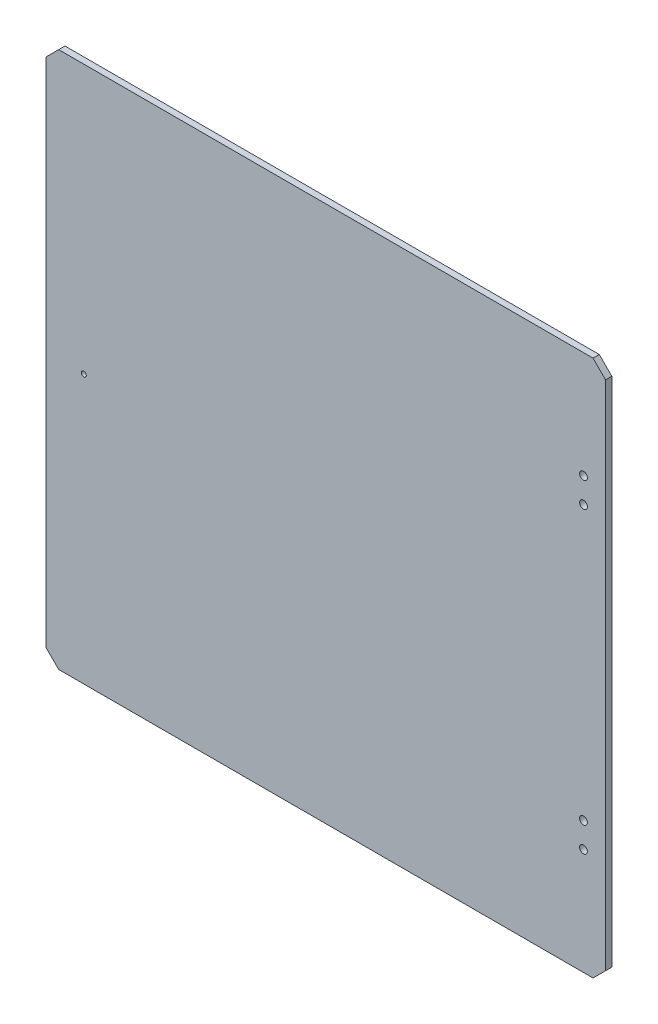
ISO-10303-21;
HEADER;
FILE_DESCRIPTION(('STEP AP214'),'2;1');
FILE_NAME('part.step','',(''),(''),'','','');
FILE_SCHEMA(('AUTOMOTIVE_DESIGN { 1 0 10303 214 1 1 1 1 }'));
ENDSEC;
DATA;
#1=APPLICATION_CONTEXT('core data for automotive mechanical design processes');
#2=APPLICATION_PROTOCOL_DEFINITION('international standard','automotive_design',2000,#1);
#3=PRODUCT_CONTEXT('',#1,'mechanical');
#4=PRODUCT('Part','Part','',(#3));
#5=PRODUCT_RELATED_PRODUCT_CATEGORY('part','',(#4));
#6=PRODUCT_DEFINITION_FORMATION('','',#4);
#7=PRODUCT_DEFINITION_CONTEXT('part definition',#1,'design');
#8=PRODUCT_DEFINITION('design','',#6,#7);
#9=PRODUCT_DEFINITION_SHAPE('','',#8);
#10=(LENGTH_UNIT() NAMED_UNIT(*) SI_UNIT(.MILLI.,.METRE.));
#11=(NAMED_UNIT(*) PLANE_ANGLE_UNIT() SI_UNIT($,.RADIAN.));
#12=(NAMED_UNIT(*) SI_UNIT($,.STERADIAN.) SOLID_ANGLE_UNIT());
#13=UNCERTAINTY_MEASURE_WITH_UNIT(LENGTH_MEASURE(1.E-05),#10,'distance_accuracy_value','');
#14=(GEOMETRIC_REPRESENTATION_CONTEXT(3) GLOBAL_UNCERTAINTY_ASSIGNED_CONTEXT((#13)) GLOBAL_UNIT_ASSIGNED_CONTEXT((#10,
#11,#12)) REPRESENTATION_CONTEXT('',''));
#15=CARTESIAN_POINT('',(0.,0.,0.));
#16=DIRECTION('',(0.,0.,1.));
#17=DIRECTION('',(1.,0.,0.));
#18=AXIS2_PLACEMENT_3D('',#15,#16,#17);
#19=CARTESIAN_POINT('',(0.,0.,5.));
#20=DIRECTION('',(0.,0.,1.));
#21=DIRECTION('',(1.,0.,0.));
#22=AXIS2_PLACEMENT_3D('',#19,#20,#21);
#23=PLANE('',#22);
#24=CARTESIAN_POINT('',(205.4,-129.,5.));
#25=DIRECTION('',(0.,0.,1.));
#26=DIRECTION('',(-1.,0.,0.));
#27=AXIS2_PLACEMENT_3D('',#24,#25,#26);
#28=CIRCLE('',#27,3.09999999999999);
#29=CARTESIAN_POINT('',(202.3,-129.,5.));
#30=VERTEX_POINT('',#29);
#31=EDGE_CURVE('E209',#30,#30,#28,.T.);
#32=ORIENTED_EDGE('',*,*,#31,.F.);
#33=EDGE_LOOP('',(#32));
#34=FACE_BOUND('',#33,.T.);
#35=CARTESIAN_POINT('',(205.4,109.,5.));
#36=DIRECTION('',(0.,0.,1.));
#37=DIRECTION('',(1.,0.,0.));
#38=AXIS2_PLACEMENT_3D('',#35,#36,#37);
#39=CIRCLE('',#38,3.09999999999999);
#40=CARTESIAN_POINT('',(208.5,109.,5.));
#41=VERTEX_POINT('',#40);
#42=EDGE_CURVE('E195',#41,#41,#39,.T.);
#43=ORIENTED_EDGE('',*,*,#42,.F.);
#44=EDGE_LOOP('',(#43));
#45=FACE_BOUND('',#44,.T.);
#46=DIRECTION('',(0.,-1.,0.));
#47=VECTOR('',#46,1.);
#48=CARTESIAN_POINT('',(-223.,-204.,5.));
#49=LINE('',#48,#47);
#50=CARTESIAN_POINT('',(-223.,204.,5.));
#51=VERTEX_POINT('',#50);
#52=CARTESIAN_POINT('',(-223.,-204.,5.));
#53=VERTEX_POINT('',#52);
#54=EDGE_CURVE('E158',#51,#53,#49,.T.);
#55=ORIENTED_EDGE('',*,*,#54,.T.);
#56=DIRECTION('',(0.707106781186548,-0.707106781186546,0.));
#57=VECTOR('',#56,1.);
#58=CARTESIAN_POINT('',(-213.,-214.,5.));
#59=LINE('',#58,#57);
#60=CARTESIAN_POINT('',(-213.,-214.,5.));
#61=VERTEX_POINT('',#60);
#62=EDGE_CURVE('E105',#53,#61,#59,.T.);
#63=ORIENTED_EDGE('',*,*,#62,.T.);
#64=DIRECTION('',(1.,0.,0.));
#65=VECTOR('',#64,1.);
#66=CARTESIAN_POINT('',(213.,-214.,5.));
#67=LINE('',#66,#65);
#68=CARTESIAN_POINT('',(213.,-214.,5.));
#69=VERTEX_POINT('',#68);
#70=EDGE_CURVE('E173',#61,#69,#67,.T.);
#71=ORIENTED_EDGE('',*,*,#70,.T.);
#72=DIRECTION('',(0.707106781186547,0.707106781186547,0.));
#73=VECTOR('',#72,1.);
#74=CARTESIAN_POINT('',(213.,-214.,5.));
#75=LINE('',#74,#73);
#76=CARTESIAN_POINT('',(223.,-204.,5.));
#77=VERTEX_POINT('',#76);
#78=EDGE_CURVE('E186',#69,#77,#75,.T.);
#79=ORIENTED_EDGE('',*,*,#78,.T.);
#80=DIRECTION('',(0.,1.,0.));
#81=VECTOR('',#80,1.);
#82=CARTESIAN_POINT('',(223.,204.,5.));
#83=LINE('',#82,#81);
#84=CARTESIAN_POINT('',(223.,204.,5.));
#85=VERTEX_POINT('',#84);
#86=EDGE_CURVE('E125',#77,#85,#83,.T.);
#87=ORIENTED_EDGE('',*,*,#86,.T.);
#88=DIRECTION('',(-0.707106781186547,0.707106781186547,0.));
#89=VECTOR('',#88,1.);
#90=CARTESIAN_POINT('',(223.,204.,5.));
#91=LINE('',#90,#89);
#92=CARTESIAN_POINT('',(213.,214.,5.));
#93=VERTEX_POINT('',#92);
#94=EDGE_CURVE('E119',#85,#93,#91,.T.);
#95=ORIENTED_EDGE('',*,*,#94,.T.);
#96=DIRECTION('',(-1.,0.,0.));
#97=VECTOR('',#96,1.);
#98=CARTESIAN_POINT('',(213.,214.,5.));
#99=LINE('',#98,#97);
#100=CARTESIAN_POINT('',(-213.,214.,5.));
#101=VERTEX_POINT('',#100);
#102=EDGE_CURVE('E123',#93,#101,#99,.T.);
#103=ORIENTED_EDGE('',*,*,#102,.T.);
#104=DIRECTION('',(-0.70710678118655,-0.707106781186544,0.));
#105=VECTOR('',#104,1.);
#106=CARTESIAN_POINT('',(-223.,204.,5.));
#107=LINE('',#106,#105);
#108=EDGE_CURVE('E62',#101,#51,#107,.T.);
#109=ORIENTED_EDGE('',*,*,#108,.T.);
#110=EDGE_LOOP('',(#55,#63,#71,#79,#87,#95,#103,#109));
#111=FACE_BOUND('',#110,.T.);
#112=CARTESIAN_POINT('',(205.4,129.,5.));
#113=DIRECTION('',(0.,0.,1.));
#114=DIRECTION('',(1.,0.,0.));
#115=AXIS2_PLACEMENT_3D('',#112,#113,#114);
#116=CIRCLE('',#115,3.09999999999999);
#117=CARTESIAN_POINT('',(208.5,129.,5.));
#118=VERTEX_POINT('',#117);
#119=EDGE_CURVE('E147',#118,#118,#116,.T.);
#120=ORIENTED_EDGE('',*,*,#119,.F.);
#121=EDGE_LOOP('',(#120));
#122=FACE_BOUND('',#121,.T.);
#123=CARTESIAN_POINT('',(205.4,-109.,5.));
#124=DIRECTION('',(0.,0.,1.));
#125=DIRECTION('',(-1.,0.,0.));
#126=AXIS2_PLACEMENT_3D('',#123,#124,#125);
#127=CIRCLE('',#126,3.09999999999999);
#128=CARTESIAN_POINT('',(202.3,-109.,5.));
#129=VERTEX_POINT('',#128);
#130=EDGE_CURVE('E202',#129,#129,#127,.T.);
#131=ORIENTED_EDGE('',*,*,#130,.F.);
#132=EDGE_LOOP('',(#131));
#133=FACE_BOUND('',#132,.T.);
#134=CARTESIAN_POINT('',(-193.,0.,5.));
#135=DIRECTION('',(0.,0.,1.));
#136=DIRECTION('',(1.,0.,0.));
#137=AXIS2_PLACEMENT_3D('',#134,#135,#136);
#138=CIRCLE('',#137,2.);
#139=CARTESIAN_POINT('',(-191.,0.,5.));
#140=VERTEX_POINT('',#139);
#141=EDGE_CURVE('E216',#140,#140,#138,.T.);
#142=ORIENTED_EDGE('',*,*,#141,.F.);
#143=EDGE_LOOP('',(#142));
#144=FACE_BOUND('',#143,.T.);
#145=ADVANCED_FACE('F45',(#34,#45,#111,#122,#133,#144),#23,.T.);
#146=CARTESIAN_POINT('',(0.,0.,0.));
#147=DIRECTION('',(0.,0.,1.));
#148=DIRECTION('',(1.,0.,0.));
#149=AXIS2_PLACEMENT_3D('',#146,#147,#148);
#150=PLANE('',#149);
#151=DIRECTION('',(0.,-1.,0.));
#152=VECTOR('',#151,1.);
#153=CARTESIAN_POINT('',(-223.,-204.,0.));
#154=LINE('',#153,#152);
#155=CARTESIAN_POINT('',(-223.,204.,0.));
#156=VERTEX_POINT('',#155);
#157=CARTESIAN_POINT('',(-223.,-204.,0.));
#158=VERTEX_POINT('',#157);
#159=EDGE_CURVE('E143',#156,#158,#154,.T.);
#160=ORIENTED_EDGE('',*,*,#159,.F.);
#161=DIRECTION('',(-0.70710678118655,-0.707106781186544,0.));
#162=VECTOR('',#161,1.);
#163=CARTESIAN_POINT('',(-223.,204.,0.));
#164=LINE('',#163,#162);
#165=CARTESIAN_POINT('',(-213.,214.,0.));
#166=VERTEX_POINT('',#165);
#167=EDGE_CURVE('E97',#166,#156,#164,.T.);
#168=ORIENTED_EDGE('',*,*,#167,.F.);
#169=DIRECTION('',(-1.,0.,0.));
#170=VECTOR('',#169,1.);
#171=CARTESIAN_POINT('',(213.,214.,0.));
#172=LINE('',#171,#170);
#173=CARTESIAN_POINT('',(213.,214.,0.));
#174=VERTEX_POINT('',#173);
#175=EDGE_CURVE('E91',#174,#166,#172,.T.);
#176=ORIENTED_EDGE('',*,*,#175,.F.);
#177=DIRECTION('',(-0.707106781186547,0.707106781186547,0.));
#178=VECTOR('',#177,1.);
#179=CARTESIAN_POINT('',(223.,204.,0.));
#180=LINE('',#179,#178);
#181=CARTESIAN_POINT('',(223.,204.,0.));
#182=VERTEX_POINT('',#181);
#183=EDGE_CURVE('E133',#182,#174,#180,.T.);
#184=ORIENTED_EDGE('',*,*,#183,.F.);
#185=DIRECTION('',(0.,1.,0.));
#186=VECTOR('',#185,1.);
#187=CARTESIAN_POINT('',(223.,204.,0.));
#188=LINE('',#187,#186);
#189=CARTESIAN_POINT('',(223.,-204.,0.));
#190=VERTEX_POINT('',#189);
#191=EDGE_CURVE('E153',#190,#182,#188,.T.);
#192=ORIENTED_EDGE('',*,*,#191,.F.);
#193=DIRECTION('',(0.707106781186547,0.707106781186547,0.));
#194=VECTOR('',#193,1.);
#195=CARTESIAN_POINT('',(213.,-214.,0.));
#196=LINE('',#195,#194);
#197=CARTESIAN_POINT('',(213.,-214.,0.));
#198=VERTEX_POINT('',#197);
#199=EDGE_CURVE('E151',#198,#190,#196,.T.);
#200=ORIENTED_EDGE('',*,*,#199,.F.);
#201=DIRECTION('',(1.,0.,0.));
#202=VECTOR('',#201,1.);
#203=CARTESIAN_POINT('',(213.,-214.,0.));
#204=LINE('',#203,#202);
#205=CARTESIAN_POINT('',(-213.,-214.,0.));
#206=VERTEX_POINT('',#205);
#207=EDGE_CURVE('E149',#206,#198,#204,.T.);
#208=ORIENTED_EDGE('',*,*,#207,.F.);
#209=DIRECTION('',(0.707106781186548,-0.707106781186546,0.));
#210=VECTOR('',#209,1.);
#211=CARTESIAN_POINT('',(-213.,-214.,0.));
#212=LINE('',#211,#210);
#213=EDGE_CURVE('E146',#158,#206,#212,.T.);
#214=ORIENTED_EDGE('',*,*,#213,.F.);
#215=EDGE_LOOP('',(#160,#168,#176,#184,#192,#200,#208,#214));
#216=FACE_BOUND('',#215,.T.);
#217=CARTESIAN_POINT('',(205.4,129.,0.));
#218=DIRECTION('',(0.,0.,1.));
#219=DIRECTION('',(1.,0.,0.));
#220=AXIS2_PLACEMENT_3D('',#217,#218,#219);
#221=CIRCLE('',#220,3.09999999999999);
#222=CARTESIAN_POINT('',(208.5,129.,0.));
#223=VERTEX_POINT('',#222);
#224=EDGE_CURVE('E192',#223,#223,#221,.T.);
#225=ORIENTED_EDGE('',*,*,#224,.T.);
#226=EDGE_LOOP('',(#225));
#227=FACE_BOUND('',#226,.T.);
#228=CARTESIAN_POINT('',(205.4,109.,0.));
#229=DIRECTION('',(0.,0.,1.));
#230=DIRECTION('',(1.,0.,0.));
#231=AXIS2_PLACEMENT_3D('',#228,#229,#230);
#232=CIRCLE('',#231,3.09999999999999);
#233=CARTESIAN_POINT('',(208.5,109.,0.));
#234=VERTEX_POINT('',#233);
#235=EDGE_CURVE('E199',#234,#234,#232,.T.);
#236=ORIENTED_EDGE('',*,*,#235,.T.);
#237=EDGE_LOOP('',(#236));
#238=FACE_BOUND('',#237,.T.);
#239=CARTESIAN_POINT('',(205.4,-109.,0.));
#240=DIRECTION('',(0.,0.,1.));
#241=DIRECTION('',(-1.,0.,0.));
#242=AXIS2_PLACEMENT_3D('',#239,#240,#241);
#243=CIRCLE('',#242,3.09999999999999);
#244=CARTESIAN_POINT('',(202.3,-109.,0.));
#245=VERTEX_POINT('',#244);
#246=EDGE_CURVE('E206',#245,#245,#243,.T.);
#247=ORIENTED_EDGE('',*,*,#246,.T.);
#248=EDGE_LOOP('',(#247));
#249=FACE_BOUND('',#248,.T.);
#250=CARTESIAN_POINT('',(205.4,-129.,0.));
#251=DIRECTION('',(0.,0.,1.));
#252=DIRECTION('',(-1.,0.,0.));
#253=AXIS2_PLACEMENT_3D('',#250,#251,#252);
#254=CIRCLE('',#253,3.09999999999999);
#255=CARTESIAN_POINT('',(202.3,-129.,0.));
#256=VERTEX_POINT('',#255);
#257=EDGE_CURVE('E213',#256,#256,#254,.T.);
#258=ORIENTED_EDGE('',*,*,#257,.T.);
#259=EDGE_LOOP('',(#258));
#260=FACE_BOUND('',#259,.T.);
#261=CARTESIAN_POINT('',(-193.,0.,0.));
#262=DIRECTION('',(0.,0.,1.));
#263=DIRECTION('',(1.,0.,0.));
#264=AXIS2_PLACEMENT_3D('',#261,#262,#263);
#265=CIRCLE('',#264,2.);
#266=CARTESIAN_POINT('',(-191.,0.,0.));
#267=VERTEX_POINT('',#266);
#268=EDGE_CURVE('E220',#267,#267,#265,.T.);
#269=ORIENTED_EDGE('',*,*,#268,.T.);
#270=EDGE_LOOP('',(#269));
#271=FACE_BOUND('',#270,.T.);
#272=ADVANCED_FACE('F177',(#216,#227,#238,#249,#260,#271),#150,.F.);
#273=CARTESIAN_POINT('',(-223.,-204.,5.));
#274=DIRECTION('',(1.,0.,0.));
#275=DIRECTION('',(0.,1.,0.));
#276=AXIS2_PLACEMENT_3D('',#273,#274,#275);
#277=PLANE('',#276);
#278=ORIENTED_EDGE('',*,*,#159,.T.);
#279=DIRECTION('',(0.,0.,-1.));
#280=VECTOR('',#279,1.);
#281=CARTESIAN_POINT('',(-223.,-204.,5.));
#282=LINE('',#281,#280);
#283=EDGE_CURVE('E11',#53,#158,#282,.T.);
#284=ORIENTED_EDGE('',*,*,#283,.F.);
#285=ORIENTED_EDGE('',*,*,#54,.F.);
#286=DIRECTION('',(0.,0.,-1.));
#287=VECTOR('',#286,1.);
#288=CARTESIAN_POINT('',(-223.,204.,5.));
#289=LINE('',#288,#287);
#290=EDGE_CURVE('E139',#51,#156,#289,.T.);
#291=ORIENTED_EDGE('',*,*,#290,.T.);
#292=EDGE_LOOP('',(#278,#284,#285,#291));
#293=FACE_BOUND('',#292,.T.);
#294=ADVANCED_FACE('F47',(#293),#277,.F.);
#295=CARTESIAN_POINT('',(-213.,-214.,5.));
#296=DIRECTION('',(0.707106781186546,0.707106781186548,0.));
#297=DIRECTION('',(-0.707106781186549,0.707106781186547,0.));
#298=AXIS2_PLACEMENT_3D('',#295,#296,#297);
#299=PLANE('',#298);
#300=ORIENTED_EDGE('',*,*,#213,.T.);
#301=DIRECTION('',(0.,0.,-1.));
#302=VECTOR('',#301,1.);
#303=CARTESIAN_POINT('',(-213.,-214.,5.));
#304=LINE('',#303,#302);
#305=EDGE_CURVE('E54',#61,#206,#304,.T.);
#306=ORIENTED_EDGE('',*,*,#305,.F.);
#307=ORIENTED_EDGE('',*,*,#62,.F.);
#308=ORIENTED_EDGE('',*,*,#283,.T.);
#309=EDGE_LOOP('',(#300,#306,#307,#308));
#310=FACE_BOUND('',#309,.T.);
#311=ADVANCED_FACE('F254',(#310),#299,.F.);
#312=CARTESIAN_POINT('',(213.,-214.,5.));
#313=DIRECTION('',(0.,1.,0.));
#314=DIRECTION('',(-1.,0.,0.));
#315=AXIS2_PLACEMENT_3D('',#312,#313,#314);
#316=PLANE('',#315);
#317=ORIENTED_EDGE('',*,*,#207,.T.);
#318=DIRECTION('',(0.,0.,-1.));
#319=VECTOR('',#318,1.);
#320=CARTESIAN_POINT('',(213.,-214.,5.));
#321=LINE('',#320,#319);
#322=EDGE_CURVE('E165',#69,#198,#321,.T.);
#323=ORIENTED_EDGE('',*,*,#322,.F.);
#324=ORIENTED_EDGE('',*,*,#70,.F.);
#325=ORIENTED_EDGE('',*,*,#305,.T.);
#326=EDGE_LOOP('',(#317,#323,#324,#325));
#327=FACE_BOUND('',#326,.T.);
#328=ADVANCED_FACE('F171',(#327),#316,.F.);
#329=CARTESIAN_POINT('',(213.,-214.,5.));
#330=DIRECTION('',(-0.707106781186548,0.707106781186548,0.));
#331=DIRECTION('',(-0.707106781186548,-0.707106781186548,0.));
#332=AXIS2_PLACEMENT_3D('',#329,#330,#331);
#333=PLANE('',#332);
#334=ORIENTED_EDGE('',*,*,#199,.T.);
#335=DIRECTION('',(0.,0.,-1.));
#336=VECTOR('',#335,1.);
#337=CARTESIAN_POINT('',(223.,-204.,5.));
#338=LINE('',#337,#336);
#339=EDGE_CURVE('E162',#77,#190,#338,.T.);
#340=ORIENTED_EDGE('',*,*,#339,.F.);
#341=ORIENTED_EDGE('',*,*,#78,.F.);
#342=ORIENTED_EDGE('',*,*,#322,.T.);
#343=EDGE_LOOP('',(#334,#340,#341,#342));
#344=FACE_BOUND('',#343,.T.);
#345=ADVANCED_FACE('F182',(#344),#333,.F.);
#346=CARTESIAN_POINT('',(223.,204.,5.));
#347=DIRECTION('',(-1.,0.,0.));
#348=DIRECTION('',(0.,0.,1.));
#349=AXIS2_PLACEMENT_3D('',#346,#347,#348);
#350=PLANE('',#349);
#351=ORIENTED_EDGE('',*,*,#191,.T.);
#352=DIRECTION('',(0.,0.,-1.));
#353=VECTOR('',#352,1.);
#354=CARTESIAN_POINT('',(223.,204.,5.));
#355=LINE('',#354,#353);
#356=EDGE_CURVE('E134',#85,#182,#355,.T.);
#357=ORIENTED_EDGE('',*,*,#356,.F.);
#358=ORIENTED_EDGE('',*,*,#86,.F.);
#359=ORIENTED_EDGE('',*,*,#339,.T.);
#360=EDGE_LOOP('',(#351,#357,#358,#359));
#361=FACE_BOUND('',#360,.T.);
#362=ADVANCED_FACE('F185',(#361),#350,.F.);
#363=CARTESIAN_POINT('',(223.,204.,5.));
#364=DIRECTION('',(-0.707106781186548,-0.707106781186548,0.));
#365=DIRECTION('',(0.707106781186548,-0.707106781186548,0.));
#366=AXIS2_PLACEMENT_3D('',#363,#364,#365);
#367=PLANE('',#366);
#368=ORIENTED_EDGE('',*,*,#183,.T.);
#369=DIRECTION('',(0.,0.,-1.));
#370=VECTOR('',#369,1.);
#371=CARTESIAN_POINT('',(213.,214.,5.));
#372=LINE('',#371,#370);
#373=EDGE_CURVE('E130',#93,#174,#372,.T.);
#374=ORIENTED_EDGE('',*,*,#373,.F.);
#375=ORIENTED_EDGE('',*,*,#94,.F.);
#376=ORIENTED_EDGE('',*,*,#356,.T.);
#377=EDGE_LOOP('',(#368,#374,#375,#376));
#378=FACE_BOUND('',#377,.T.);
#379=ADVANCED_FACE('F131',(#378),#367,.F.);
#380=CARTESIAN_POINT('',(213.,214.,5.));
#381=DIRECTION('',(0.,-1.,0.));
#382=DIRECTION('',(1.,0.,0.));
#383=AXIS2_PLACEMENT_3D('',#380,#381,#382);
#384=PLANE('',#383);
#385=ORIENTED_EDGE('',*,*,#175,.T.);
#386=DIRECTION('',(0.,0.,-1.));
#387=VECTOR('',#386,1.);
#388=CARTESIAN_POINT('',(-213.,214.,5.));
#389=LINE('',#388,#387);
#390=EDGE_CURVE('E135',#101,#166,#389,.T.);
#391=ORIENTED_EDGE('',*,*,#390,.F.);
#392=ORIENTED_EDGE('',*,*,#102,.F.);
#393=ORIENTED_EDGE('',*,*,#373,.T.);
#394=EDGE_LOOP('',(#385,#391,#392,#393));
#395=FACE_BOUND('',#394,.T.);
#396=ADVANCED_FACE('F137',(#395),#384,.F.);
#397=CARTESIAN_POINT('',(-223.,204.,5.));
#398=DIRECTION('',(0.707106781186544,-0.70710678118655,0.));
#399=DIRECTION('',(0.70710678118655,0.707106781186545,0.));
#400=AXIS2_PLACEMENT_3D('',#397,#398,#399);
#401=PLANE('',#400);
#402=ORIENTED_EDGE('',*,*,#167,.T.);
#403=ORIENTED_EDGE('',*,*,#290,.F.);
#404=ORIENTED_EDGE('',*,*,#108,.F.);
#405=ORIENTED_EDGE('',*,*,#390,.T.);
#406=EDGE_LOOP('',(#402,#403,#404,#405));
#407=FACE_BOUND('',#406,.T.);
#408=ADVANCED_FACE('F242',(#407),#401,.F.);
#409=CARTESIAN_POINT('',(205.4,129.,5.));
#410=DIRECTION('',(0.,0.,-1.));
#411=DIRECTION('',(-1.,0.,0.));
#412=AXIS2_PLACEMENT_3D('',#409,#410,#411);
#413=CYLINDRICAL_SURFACE('',#412,3.09999999999999);
#414=ORIENTED_EDGE('',*,*,#119,.T.);
#415=EDGE_LOOP('',(#414));
#416=FACE_BOUND('',#415,.T.);
#417=ORIENTED_EDGE('',*,*,#224,.F.);
#418=EDGE_LOOP('',(#417));
#419=FACE_BOUND('',#418,.T.);
#420=ADVANCED_FACE('F239',(#416,#419),#413,.F.);
#421=CARTESIAN_POINT('',(205.4,109.,5.));
#422=DIRECTION('',(0.,0.,-1.));
#423=DIRECTION('',(-1.,0.,0.));
#424=AXIS2_PLACEMENT_3D('',#421,#422,#423);
#425=CYLINDRICAL_SURFACE('',#424,3.09999999999999);
#426=ORIENTED_EDGE('',*,*,#42,.T.);
#427=EDGE_LOOP('',(#426));
#428=FACE_BOUND('',#427,.T.);
#429=ORIENTED_EDGE('',*,*,#235,.F.);
#430=EDGE_LOOP('',(#429));
#431=FACE_BOUND('',#430,.T.);
#432=ADVANCED_FACE('F327',(#428,#431),#425,.F.);
#433=CARTESIAN_POINT('',(205.4,-109.,5.));
#434=DIRECTION('',(0.,0.,-1.));
#435=DIRECTION('',(-1.,0.,0.));
#436=AXIS2_PLACEMENT_3D('',#433,#434,#435);
#437=CYLINDRICAL_SURFACE('',#436,3.09999999999999);
#438=ORIENTED_EDGE('',*,*,#130,.T.);
#439=EDGE_LOOP('',(#438));
#440=FACE_BOUND('',#439,.T.);
#441=ORIENTED_EDGE('',*,*,#246,.F.);
#442=EDGE_LOOP('',(#441));
#443=FACE_BOUND('',#442,.T.);
#444=ADVANCED_FACE('F335',(#440,#443),#437,.F.);
#445=CARTESIAN_POINT('',(205.4,-129.,5.));
#446=DIRECTION('',(0.,0.,-1.));
#447=DIRECTION('',(-1.,0.,0.));
#448=AXIS2_PLACEMENT_3D('',#445,#446,#447);
#449=CYLINDRICAL_SURFACE('',#448,3.09999999999999);
#450=ORIENTED_EDGE('',*,*,#31,.T.);
#451=EDGE_LOOP('',(#450));
#452=FACE_BOUND('',#451,.T.);
#453=ORIENTED_EDGE('',*,*,#257,.F.);
#454=EDGE_LOOP('',(#453));
#455=FACE_BOUND('',#454,.T.);
#456=ADVANCED_FACE('F343',(#452,#455),#449,.F.);
#457=CARTESIAN_POINT('',(-193.,0.,5.));
#458=DIRECTION('',(0.,0.,-1.));
#459=DIRECTION('',(-1.,0.,0.));
#460=AXIS2_PLACEMENT_3D('',#457,#458,#459);
#461=CYLINDRICAL_SURFACE('',#460,2.);
#462=ORIENTED_EDGE('',*,*,#141,.T.);
#463=EDGE_LOOP('',(#462));
#464=FACE_BOUND('',#463,.T.);
#465=ORIENTED_EDGE('',*,*,#268,.F.);
#466=EDGE_LOOP('',(#465));
#467=FACE_BOUND('',#466,.T.);
#468=ADVANCED_FACE('F226',(#464,#467),#461,.F.);
#469=CLOSED_SHELL('',(#145,#272,#294,#311,#328,#345,#362,#379,#396,#408,#420,#432,#444,#456,#468));
#470=MANIFOLD_SOLID_BREP('B2',#469);
#471=ADVANCED_BREP_SHAPE_REPRESENTATION('',(#18,#470),#14);
#472=SHAPE_DEFINITION_REPRESENTATION(#9,#471);
ENDSEC;
END-ISO-10303-21;
